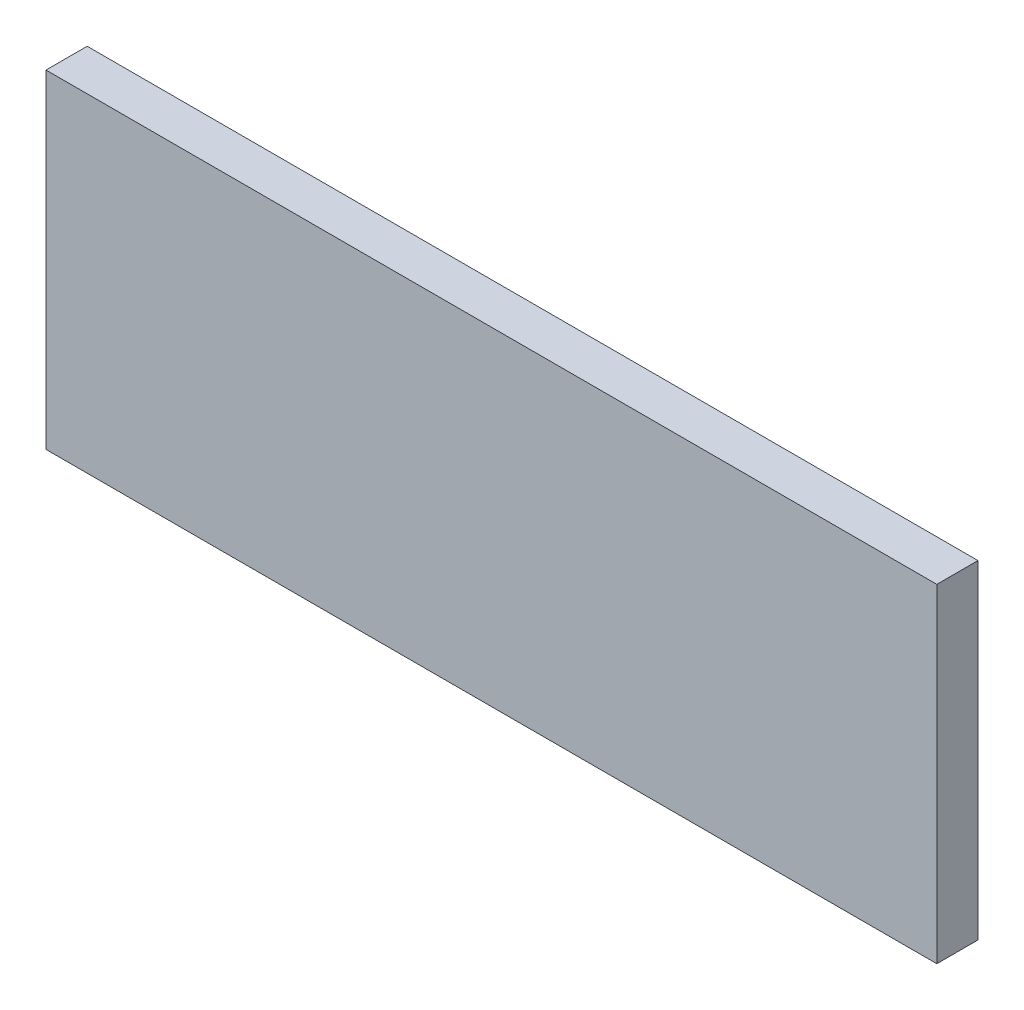
ISO-10303-21;
HEADER;
FILE_DESCRIPTION(('STEP AP214'),'2;1');
FILE_NAME('part.step','',(''),(''),'','','');
FILE_SCHEMA(('AUTOMOTIVE_DESIGN { 1 0 10303 214 1 1 1 1 }'));
ENDSEC;
DATA;
#1=APPLICATION_CONTEXT('core data for automotive mechanical design processes');
#2=APPLICATION_PROTOCOL_DEFINITION('international standard','automotive_design',2000,#1);
#3=PRODUCT_CONTEXT('',#1,'mechanical');
#4=PRODUCT('Part','Part','',(#3));
#5=PRODUCT_RELATED_PRODUCT_CATEGORY('part','',(#4));
#6=PRODUCT_DEFINITION_FORMATION('','',#4);
#7=PRODUCT_DEFINITION_CONTEXT('part definition',#1,'design');
#8=PRODUCT_DEFINITION('design','',#6,#7);
#9=PRODUCT_DEFINITION_SHAPE('','',#8);
#10=(LENGTH_UNIT() NAMED_UNIT(*) SI_UNIT(.MILLI.,.METRE.));
#11=(NAMED_UNIT(*) PLANE_ANGLE_UNIT() SI_UNIT($,.RADIAN.));
#12=(NAMED_UNIT(*) SI_UNIT($,.STERADIAN.) SOLID_ANGLE_UNIT());
#13=UNCERTAINTY_MEASURE_WITH_UNIT(LENGTH_MEASURE(1.E-05),#10,'distance_accuracy_value','');
#14=(GEOMETRIC_REPRESENTATION_CONTEXT(3) GLOBAL_UNCERTAINTY_ASSIGNED_CONTEXT((#13)) GLOBAL_UNIT_ASSIGNED_CONTEXT((#10,
#11,#12)) REPRESENTATION_CONTEXT('',''));
#15=CARTESIAN_POINT('',(0.,0.,0.));
#16=DIRECTION('',(0.,0.,1.));
#17=DIRECTION('',(1.,0.,0.));
#18=AXIS2_PLACEMENT_3D('',#15,#16,#17);
#19=CARTESIAN_POINT('',(21.62700272,7.97699954,0.));
#20=DIRECTION('',(-5.87228890024599E-08,-0.999999999999998,0.));
#21=DIRECTION('',(-0.999999999999998,5.87228890024599E-08,0.));
#22=AXIS2_PLACEMENT_3D('',#19,#20,#21);
#23=PLANE('',#22);
#24=DIRECTION('',(-0.999999999999998,5.87228890024599E-08,0.));
#25=VECTOR('',#24,1.);
#26=CARTESIAN_POINT('',(21.62700272,7.97699954,0.));
#27=LINE('',#26,#25);
#28=CARTESIAN_POINT('',(21.62700272,7.97699954,0.));
#29=VERTEX_POINT('',#28);
#30=CARTESIAN_POINT('',(-21.62700018,7.97700208,0.));
#31=VERTEX_POINT('',#30);
#32=EDGE_CURVE('E11',#29,#31,#27,.T.);
#33=ORIENTED_EDGE('',*,*,#32,.T.);
#34=DIRECTION('',(0.,0.,1.));
#35=VECTOR('',#34,1.);
#36=CARTESIAN_POINT('',(-21.62700018,7.97700208,0.));
#37=LINE('',#36,#35);
#38=CARTESIAN_POINT('',(-21.62700018,7.97700208,2.00000108));
#39=VERTEX_POINT('',#38);
#40=EDGE_CURVE('E23',#31,#39,#37,.T.);
#41=ORIENTED_EDGE('',*,*,#40,.T.);
#42=DIRECTION('',(-0.999999999999998,5.87228890024599E-08,0.));
#43=VECTOR('',#42,1.);
#44=CARTESIAN_POINT('',(21.62700272,7.97699954,2.00000108));
#45=LINE('',#44,#43);
#46=CARTESIAN_POINT('',(21.62700272,7.97699954,2.00000108));
#47=VERTEX_POINT('',#46);
#48=EDGE_CURVE('E86',#47,#39,#45,.T.);
#49=ORIENTED_EDGE('',*,*,#48,.F.);
#50=DIRECTION('',(0.,0.,1.));
#51=VECTOR('',#50,1.);
#52=CARTESIAN_POINT('',(21.62700272,7.97699954,0.));
#53=LINE('',#52,#51);
#54=EDGE_CURVE('E35',#29,#47,#53,.T.);
#55=ORIENTED_EDGE('',*,*,#54,.F.);
#56=EDGE_LOOP('',(#33,#41,#49,#55));
#57=FACE_BOUND('',#56,.T.);
#58=ADVANCED_FACE('F16',(#57),#23,.F.);
#59=CARTESIAN_POINT('',(-21.62700018,7.97700208,0.));
#60=DIRECTION('',(1.,0.,0.));
#61=DIRECTION('',(0.,-1.,0.));
#62=AXIS2_PLACEMENT_3D('',#59,#60,#61);
#63=PLANE('',#62);
#64=DIRECTION('',(0.,-1.,0.));
#65=VECTOR('',#64,1.);
#66=CARTESIAN_POINT('',(-21.62700018,7.97700208,0.));
#67=LINE('',#66,#65);
#68=CARTESIAN_POINT('',(-21.62700018,-7.97700208,0.));
#69=VERTEX_POINT('',#68);
#70=EDGE_CURVE('E83',#31,#69,#67,.T.);
#71=ORIENTED_EDGE('',*,*,#70,.T.);
#72=DIRECTION('',(0.,0.,1.));
#73=VECTOR('',#72,1.);
#74=CARTESIAN_POINT('',(-21.62700018,-7.97700208,0.));
#75=LINE('',#74,#73);
#76=CARTESIAN_POINT('',(-21.62700018,-7.97700208,2.00000108));
#77=VERTEX_POINT('',#76);
#78=EDGE_CURVE('E81',#69,#77,#75,.T.);
#79=ORIENTED_EDGE('',*,*,#78,.T.);
#80=DIRECTION('',(0.,-1.,0.));
#81=VECTOR('',#80,1.);
#82=CARTESIAN_POINT('',(-21.62700018,7.97700208,2.00000108));
#83=LINE('',#82,#81);
#84=EDGE_CURVE('E61',#39,#77,#83,.T.);
#85=ORIENTED_EDGE('',*,*,#84,.F.);
#86=ORIENTED_EDGE('',*,*,#40,.F.);
#87=EDGE_LOOP('',(#71,#79,#85,#86));
#88=FACE_BOUND('',#87,.T.);
#89=ADVANCED_FACE('F88',(#88),#63,.F.);
#90=CARTESIAN_POINT('',(-21.62700018,-7.97700208,0.));
#91=DIRECTION('',(0.,1.,0.));
#92=DIRECTION('',(1.,0.,0.));
#93=AXIS2_PLACEMENT_3D('',#90,#91,#92);
#94=PLANE('',#93);
#95=DIRECTION('',(1.,0.,0.));
#96=VECTOR('',#95,1.);
#97=CARTESIAN_POINT('',(-21.62700018,-7.97700208,0.));
#98=LINE('',#97,#96);
#99=CARTESIAN_POINT('',(21.62700018,-7.97700208,0.));
#100=VERTEX_POINT('',#99);
#101=EDGE_CURVE('E70',#69,#100,#98,.T.);
#102=ORIENTED_EDGE('',*,*,#101,.T.);
#103=DIRECTION('',(0.,0.,1.));
#104=VECTOR('',#103,1.);
#105=CARTESIAN_POINT('',(21.62700018,-7.97700208,0.));
#106=LINE('',#105,#104);
#107=CARTESIAN_POINT('',(21.62700018,-7.97700208,2.00000108));
#108=VERTEX_POINT('',#107);
#109=EDGE_CURVE('E64',#100,#108,#106,.T.);
#110=ORIENTED_EDGE('',*,*,#109,.T.);
#111=DIRECTION('',(1.,0.,0.));
#112=VECTOR('',#111,1.);
#113=CARTESIAN_POINT('',(-21.62700018,-7.97700208,2.00000108));
#114=LINE('',#113,#112);
#115=EDGE_CURVE('E56',#77,#108,#114,.T.);
#116=ORIENTED_EDGE('',*,*,#115,.F.);
#117=ORIENTED_EDGE('',*,*,#78,.F.);
#118=EDGE_LOOP('',(#102,#110,#116,#117));
#119=FACE_BOUND('',#118,.T.);
#120=ADVANCED_FACE('F68',(#119),#94,.F.);
#121=CARTESIAN_POINT('',(21.62700018,-7.97700208,0.));
#122=DIRECTION('',(-0.999999999999987,1.59207705846898E-07,0.));
#123=DIRECTION('',(1.59207705846898E-07,0.999999999999987,0.));
#124=AXIS2_PLACEMENT_3D('',#121,#122,#123);
#125=PLANE('',#124);
#126=DIRECTION('',(1.59207705846898E-07,0.999999999999987,0.));
#127=VECTOR('',#126,1.);
#128=CARTESIAN_POINT('',(21.62700018,-7.97700208,0.));
#129=LINE('',#128,#127);
#130=EDGE_CURVE('E65',#100,#29,#129,.T.);
#131=ORIENTED_EDGE('',*,*,#130,.T.);
#132=ORIENTED_EDGE('',*,*,#54,.T.);
#133=DIRECTION('',(1.59207705846898E-07,0.999999999999987,0.));
#134=VECTOR('',#133,1.);
#135=CARTESIAN_POINT('',(21.62700018,-7.97700208,2.00000108));
#136=LINE('',#135,#134);
#137=EDGE_CURVE('E60',#108,#47,#136,.T.);
#138=ORIENTED_EDGE('',*,*,#137,.F.);
#139=ORIENTED_EDGE('',*,*,#109,.F.);
#140=EDGE_LOOP('',(#131,#132,#138,#139));
#141=FACE_BOUND('',#140,.T.);
#142=ADVANCED_FACE('F75',(#141),#125,.F.);
#143=CARTESIAN_POINT('',(21.62700272,7.97699954,0.));
#144=DIRECTION('',(0.,0.,-1.));
#145=DIRECTION('',(-1.,0.,0.));
#146=AXIS2_PLACEMENT_3D('',#143,#144,#145);
#147=PLANE('',#146);
#148=ORIENTED_EDGE('',*,*,#130,.F.);
#149=ORIENTED_EDGE('',*,*,#101,.F.);
#150=ORIENTED_EDGE('',*,*,#70,.F.);
#151=ORIENTED_EDGE('',*,*,#32,.F.);
#152=EDGE_LOOP('',(#148,#149,#150,#151));
#153=FACE_BOUND('',#152,.T.);
#154=ADVANCED_FACE('F90',(#153),#147,.T.);
#155=CARTESIAN_POINT('',(21.62700272,7.97699954,2.00000108));
#156=DIRECTION('',(0.,0.,-1.));
#157=DIRECTION('',(-1.,0.,0.));
#158=AXIS2_PLACEMENT_3D('',#155,#156,#157);
#159=PLANE('',#158);
#160=ORIENTED_EDGE('',*,*,#48,.T.);
#161=ORIENTED_EDGE('',*,*,#84,.T.);
#162=ORIENTED_EDGE('',*,*,#115,.T.);
#163=ORIENTED_EDGE('',*,*,#137,.T.);
#164=EDGE_LOOP('',(#160,#161,#162,#163));
#165=FACE_BOUND('',#164,.T.);
#166=ADVANCED_FACE('F58',(#165),#159,.F.);
#167=CLOSED_SHELL('',(#58,#89,#120,#142,#154,#166));
#168=MANIFOLD_SOLID_BREP('B1',#167);
#169=ADVANCED_BREP_SHAPE_REPRESENTATION('',(#18,#168),#14);
#170=SHAPE_DEFINITION_REPRESENTATION(#9,#169);
ENDSEC;
END-ISO-10303-21;
